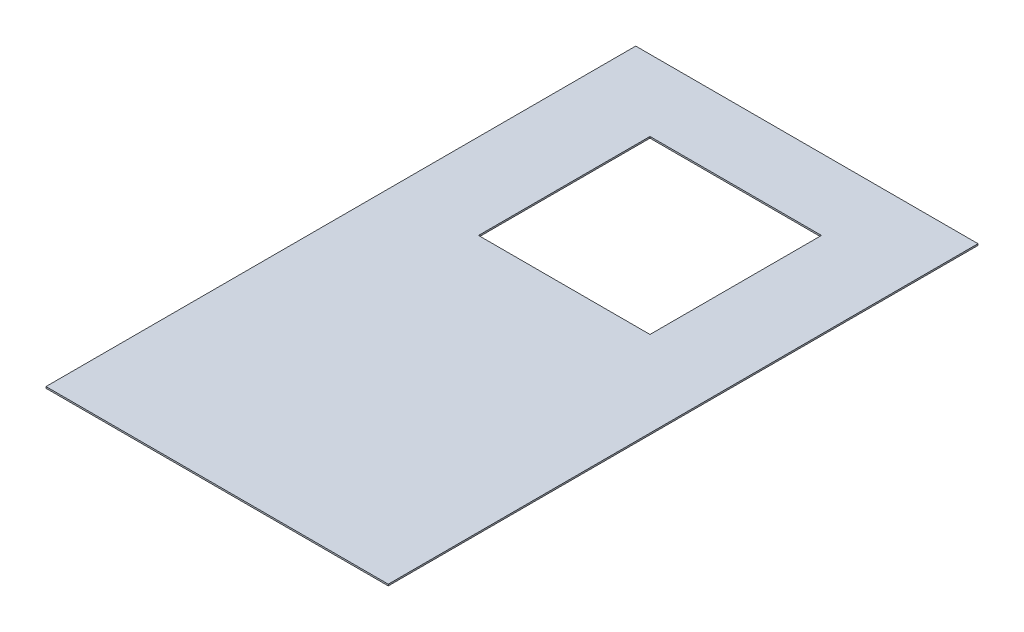
ISO-10303-21;
HEADER;
FILE_DESCRIPTION(('STEP AP214'),'2;1');
FILE_NAME('part.step','',(''),(''),'','','');
FILE_SCHEMA(('AUTOMOTIVE_DESIGN { 1 0 10303 214 1 1 1 1 }'));
ENDSEC;
DATA;
#1=APPLICATION_CONTEXT('core data for automotive mechanical design processes');
#2=APPLICATION_PROTOCOL_DEFINITION('international standard','automotive_design',2000,#1);
#3=PRODUCT_CONTEXT('',#1,'mechanical');
#4=PRODUCT('Part','Part','',(#3));
#5=PRODUCT_RELATED_PRODUCT_CATEGORY('part','',(#4));
#6=PRODUCT_DEFINITION_FORMATION('','',#4);
#7=PRODUCT_DEFINITION_CONTEXT('part definition',#1,'design');
#8=PRODUCT_DEFINITION('design','',#6,#7);
#9=PRODUCT_DEFINITION_SHAPE('','',#8);
#10=(LENGTH_UNIT() NAMED_UNIT(*) SI_UNIT(.MILLI.,.METRE.));
#11=(NAMED_UNIT(*) PLANE_ANGLE_UNIT() SI_UNIT($,.RADIAN.));
#12=(NAMED_UNIT(*) SI_UNIT($,.STERADIAN.) SOLID_ANGLE_UNIT());
#13=UNCERTAINTY_MEASURE_WITH_UNIT(LENGTH_MEASURE(1.E-05),#10,'distance_accuracy_value','');
#14=(GEOMETRIC_REPRESENTATION_CONTEXT(3) GLOBAL_UNCERTAINTY_ASSIGNED_CONTEXT((#13)) GLOBAL_UNIT_ASSIGNED_CONTEXT((#10,
#11,#12)) REPRESENTATION_CONTEXT('',''));
#15=CARTESIAN_POINT('',(0.,0.,0.));
#16=DIRECTION('',(0.,0.,1.));
#17=DIRECTION('',(1.,0.,0.));
#18=AXIS2_PLACEMENT_3D('',#15,#16,#17);
#19=CARTESIAN_POINT('',(609.6,5.55625,1050.29));
#20=DIRECTION('',(-1.,0.,0.));
#21=DIRECTION('',(0.,0.,1.));
#22=AXIS2_PLACEMENT_3D('',#19,#20,#21);
#23=PLANE('',#22);
#24=DIRECTION('',(0.,0.,-1.));
#25=VECTOR('',#24,1.);
#26=CARTESIAN_POINT('',(609.6,0.,1050.29));
#27=LINE('',#26,#25);
#28=CARTESIAN_POINT('',(609.6,0.,1050.29));
#29=VERTEX_POINT('',#28);
#30=CARTESIAN_POINT('',(609.6,0.,-1050.29));
#31=VERTEX_POINT('',#30);
#32=EDGE_CURVE('E135',#29,#31,#27,.T.);
#33=ORIENTED_EDGE('',*,*,#32,.T.);
#34=DIRECTION('',(0.,-1.,0.));
#35=VECTOR('',#34,1.);
#36=CARTESIAN_POINT('',(609.6,5.55625,-1050.29));
#37=LINE('',#36,#35);
#38=CARTESIAN_POINT('',(609.6,5.55625,-1050.29));
#39=VERTEX_POINT('',#38);
#40=EDGE_CURVE('E11',#39,#31,#37,.T.);
#41=ORIENTED_EDGE('',*,*,#40,.F.);
#42=DIRECTION('',(0.,0.,-1.));
#43=VECTOR('',#42,1.);
#44=CARTESIAN_POINT('',(609.6,5.55625,1050.29));
#45=LINE('',#44,#43);
#46=CARTESIAN_POINT('',(609.6,5.55625,1050.29));
#47=VERTEX_POINT('',#46);
#48=EDGE_CURVE('E136',#47,#39,#45,.T.);
#49=ORIENTED_EDGE('',*,*,#48,.F.);
#50=DIRECTION('',(0.,-1.,0.));
#51=VECTOR('',#50,1.);
#52=CARTESIAN_POINT('',(609.6,5.55625,1050.29));
#53=LINE('',#52,#51);
#54=EDGE_CURVE('E146',#47,#29,#53,.T.);
#55=ORIENTED_EDGE('',*,*,#54,.T.);
#56=EDGE_LOOP('',(#33,#41,#49,#55));
#57=FACE_BOUND('',#56,.T.);
#58=ADVANCED_FACE('F37',(#57),#23,.F.);
#59=CARTESIAN_POINT('',(-609.6,5.55625,-1050.29));
#60=DIRECTION('',(0.,0.,1.));
#61=DIRECTION('',(1.,0.,0.));
#62=AXIS2_PLACEMENT_3D('',#59,#60,#61);
#63=PLANE('',#62);
#64=DIRECTION('',(-1.,0.,0.));
#65=VECTOR('',#64,1.);
#66=CARTESIAN_POINT('',(-609.6,0.,-1050.29));
#67=LINE('',#66,#65);
#68=CARTESIAN_POINT('',(-609.6,0.,-1050.29));
#69=VERTEX_POINT('',#68);
#70=EDGE_CURVE('E149',#31,#69,#67,.T.);
#71=ORIENTED_EDGE('',*,*,#70,.T.);
#72=DIRECTION('',(0.,-1.,0.));
#73=VECTOR('',#72,1.);
#74=CARTESIAN_POINT('',(-609.6,5.55625,-1050.29));
#75=LINE('',#74,#73);
#76=CARTESIAN_POINT('',(-609.6,5.55625,-1050.29));
#77=VERTEX_POINT('',#76);
#78=EDGE_CURVE('E44',#77,#69,#75,.T.);
#79=ORIENTED_EDGE('',*,*,#78,.F.);
#80=DIRECTION('',(-1.,0.,0.));
#81=VECTOR('',#80,1.);
#82=CARTESIAN_POINT('',(-609.6,5.55625,-1050.29));
#83=LINE('',#82,#81);
#84=EDGE_CURVE('E139',#39,#77,#83,.T.);
#85=ORIENTED_EDGE('',*,*,#84,.F.);
#86=ORIENTED_EDGE('',*,*,#40,.T.);
#87=EDGE_LOOP('',(#71,#79,#85,#86));
#88=FACE_BOUND('',#87,.T.);
#89=ADVANCED_FACE('F177',(#88),#63,.F.);
#90=CARTESIAN_POINT('',(-609.6,5.55625,1050.29));
#91=DIRECTION('',(1.,0.,0.));
#92=DIRECTION('',(0.,0.,-1.));
#93=AXIS2_PLACEMENT_3D('',#90,#91,#92);
#94=PLANE('',#93);
#95=DIRECTION('',(0.,0.,1.));
#96=VECTOR('',#95,1.);
#97=CARTESIAN_POINT('',(-609.6,0.,1050.29));
#98=LINE('',#97,#96);
#99=CARTESIAN_POINT('',(-609.6,0.,1050.29));
#100=VERTEX_POINT('',#99);
#101=EDGE_CURVE('E151',#69,#100,#98,.T.);
#102=ORIENTED_EDGE('',*,*,#101,.T.);
#103=DIRECTION('',(0.,-1.,0.));
#104=VECTOR('',#103,1.);
#105=CARTESIAN_POINT('',(-609.6,5.55625,1050.29));
#106=LINE('',#105,#104);
#107=CARTESIAN_POINT('',(-609.6,5.55625,1050.29));
#108=VERTEX_POINT('',#107);
#109=EDGE_CURVE('E156',#108,#100,#106,.T.);
#110=ORIENTED_EDGE('',*,*,#109,.F.);
#111=DIRECTION('',(0.,0.,1.));
#112=VECTOR('',#111,1.);
#113=CARTESIAN_POINT('',(-609.6,5.55625,1050.29));
#114=LINE('',#113,#112);
#115=EDGE_CURVE('E142',#77,#108,#114,.T.);
#116=ORIENTED_EDGE('',*,*,#115,.F.);
#117=ORIENTED_EDGE('',*,*,#78,.T.);
#118=EDGE_LOOP('',(#102,#110,#116,#117));
#119=FACE_BOUND('',#118,.T.);
#120=ADVANCED_FACE('F163',(#119),#94,.F.);
#121=CARTESIAN_POINT('',(-609.6,5.55625,1050.29));
#122=DIRECTION('',(0.,0.,-1.));
#123=DIRECTION('',(-1.,0.,0.));
#124=AXIS2_PLACEMENT_3D('',#121,#122,#123);
#125=PLANE('',#124);
#126=DIRECTION('',(1.,0.,0.));
#127=VECTOR('',#126,1.);
#128=CARTESIAN_POINT('',(-609.6,0.,1050.29));
#129=LINE('',#128,#127);
#130=EDGE_CURVE('E140',#100,#29,#129,.T.);
#131=ORIENTED_EDGE('',*,*,#130,.T.);
#132=ORIENTED_EDGE('',*,*,#54,.F.);
#133=DIRECTION('',(1.,0.,0.));
#134=VECTOR('',#133,1.);
#135=CARTESIAN_POINT('',(-609.6,5.55625,1050.29));
#136=LINE('',#135,#134);
#137=EDGE_CURVE('E144',#108,#47,#136,.T.);
#138=ORIENTED_EDGE('',*,*,#137,.F.);
#139=ORIENTED_EDGE('',*,*,#109,.T.);
#140=EDGE_LOOP('',(#131,#132,#138,#139));
#141=FACE_BOUND('',#140,.T.);
#142=ADVANCED_FACE('F170',(#141),#125,.F.);
#143=CARTESIAN_POINT('',(0.,5.55625,0.));
#144=DIRECTION('',(0.,-1.,0.));
#145=DIRECTION('',(0.,0.,-1.));
#146=AXIS2_PLACEMENT_3D('',#143,#144,#145);
#147=PLANE('',#146);
#148=DIRECTION('',(-1.,0.,0.));
#149=VECTOR('',#148,1.);
#150=CARTESIAN_POINT('',(0.,5.55625,-186.054999999638));
#151=LINE('',#150,#149);
#152=CARTESIAN_POINT('',(305.43500000015,5.55625,-186.054999999638));
#153=VERTEX_POINT('',#152);
#154=CARTESIAN_POINT('',(-305.43499999985,5.55625,-186.054999999638));
#155=VERTEX_POINT('',#154);
#156=EDGE_CURVE('E124',#153,#155,#151,.T.);
#157=ORIENTED_EDGE('',*,*,#156,.T.);
#158=DIRECTION('',(0.,0.,-1.));
#159=VECTOR('',#158,1.);
#160=CARTESIAN_POINT('',(-305.43499999985,5.55625,0.));
#161=LINE('',#160,#159);
#162=CARTESIAN_POINT('',(-305.43499999985,5.55625,-796.924999999638));
#163=VERTEX_POINT('',#162);
#164=EDGE_CURVE('E105',#155,#163,#161,.T.);
#165=ORIENTED_EDGE('',*,*,#164,.T.);
#166=DIRECTION('',(-1.,0.,0.));
#167=VECTOR('',#166,1.);
#168=CARTESIAN_POINT('',(0.,5.55625,-796.924999999638));
#169=LINE('',#168,#167);
#170=CARTESIAN_POINT('',(305.43500000015,5.55625,-796.924999999638));
#171=VERTEX_POINT('',#170);
#172=EDGE_CURVE('E132',#171,#163,#169,.T.);
#173=ORIENTED_EDGE('',*,*,#172,.F.);
#174=DIRECTION('',(0.,0.,-1.));
#175=VECTOR('',#174,1.);
#176=CARTESIAN_POINT('',(305.43500000015,5.55625,0.));
#177=LINE('',#176,#175);
#178=EDGE_CURVE('E130',#153,#171,#177,.T.);
#179=ORIENTED_EDGE('',*,*,#178,.F.);
#180=EDGE_LOOP('',(#157,#165,#173,#179));
#181=FACE_BOUND('',#180,.T.);
#182=ORIENTED_EDGE('',*,*,#48,.T.);
#183=ORIENTED_EDGE('',*,*,#84,.T.);
#184=ORIENTED_EDGE('',*,*,#115,.T.);
#185=ORIENTED_EDGE('',*,*,#137,.T.);
#186=EDGE_LOOP('',(#182,#183,#184,#185));
#187=FACE_BOUND('',#186,.T.);
#188=ADVANCED_FACE('F176',(#181,#187),#147,.F.);
#189=CARTESIAN_POINT('',(0.,0.,0.));
#190=DIRECTION('',(0.,-1.,0.));
#191=DIRECTION('',(0.,0.,-1.));
#192=AXIS2_PLACEMENT_3D('',#189,#190,#191);
#193=PLANE('',#192);
#194=DIRECTION('',(0.,0.,1.));
#195=VECTOR('',#194,1.);
#196=CARTESIAN_POINT('',(-305.43499999985,0.,-796.924999999638));
#197=LINE('',#196,#195);
#198=CARTESIAN_POINT('',(-305.43499999985,0.,-796.924999999638));
#199=VERTEX_POINT('',#198);
#200=CARTESIAN_POINT('',(-305.43499999985,0.,-186.054999999638));
#201=VERTEX_POINT('',#200);
#202=EDGE_CURVE('E102',#199,#201,#197,.T.);
#203=ORIENTED_EDGE('',*,*,#202,.T.);
#204=DIRECTION('',(1.,0.,0.));
#205=VECTOR('',#204,1.);
#206=CARTESIAN_POINT('',(-305.43499999985,0.,-186.054999999638));
#207=LINE('',#206,#205);
#208=CARTESIAN_POINT('',(305.43500000015,0.,-186.054999999638));
#209=VERTEX_POINT('',#208);
#210=EDGE_CURVE('E110',#201,#209,#207,.T.);
#211=ORIENTED_EDGE('',*,*,#210,.T.);
#212=DIRECTION('',(0.,0.,1.));
#213=VECTOR('',#212,1.);
#214=CARTESIAN_POINT('',(305.43500000015,0.,-796.924999999638));
#215=LINE('',#214,#213);
#216=CARTESIAN_POINT('',(305.43500000015,0.,-796.924999999638));
#217=VERTEX_POINT('',#216);
#218=EDGE_CURVE('E114',#217,#209,#215,.T.);
#219=ORIENTED_EDGE('',*,*,#218,.F.);
#220=DIRECTION('',(1.,0.,0.));
#221=VECTOR('',#220,1.);
#222=CARTESIAN_POINT('',(-305.43499999985,0.,-796.924999999638));
#223=LINE('',#222,#221);
#224=EDGE_CURVE('E107',#199,#217,#223,.T.);
#225=ORIENTED_EDGE('',*,*,#224,.F.);
#226=EDGE_LOOP('',(#203,#211,#219,#225));
#227=FACE_BOUND('',#226,.T.);
#228=ORIENTED_EDGE('',*,*,#32,.F.);
#229=ORIENTED_EDGE('',*,*,#130,.F.);
#230=ORIENTED_EDGE('',*,*,#101,.F.);
#231=ORIENTED_EDGE('',*,*,#70,.F.);
#232=EDGE_LOOP('',(#228,#229,#230,#231));
#233=FACE_BOUND('',#232,.T.);
#234=ADVANCED_FACE('F116',(#227,#233),#193,.T.);
#235=CARTESIAN_POINT('',(-305.43499999985,0.,-796.924999999638));
#236=DIRECTION('',(-1.,0.,0.));
#237=DIRECTION('',(0.,0.,1.));
#238=AXIS2_PLACEMENT_3D('',#235,#236,#237);
#239=PLANE('',#238);
#240=DIRECTION('',(0.,1.,0.));
#241=VECTOR('',#240,1.);
#242=CARTESIAN_POINT('',(-305.43499999985,0.,-186.054999999638));
#243=LINE('',#242,#241);
#244=EDGE_CURVE('E51',#201,#155,#243,.T.);
#245=ORIENTED_EDGE('',*,*,#244,.F.);
#246=ORIENTED_EDGE('',*,*,#202,.F.);
#247=DIRECTION('',(0.,1.,0.));
#248=VECTOR('',#247,1.);
#249=CARTESIAN_POINT('',(-305.43499999985,0.,-796.924999999638));
#250=LINE('',#249,#248);
#251=EDGE_CURVE('E122',#199,#163,#250,.T.);
#252=ORIENTED_EDGE('',*,*,#251,.T.);
#253=ORIENTED_EDGE('',*,*,#164,.F.);
#254=EDGE_LOOP('',(#245,#246,#252,#253));
#255=FACE_BOUND('',#254,.T.);
#256=ADVANCED_FACE('F99',(#255),#239,.F.);
#257=CARTESIAN_POINT('',(-305.43499999985,0.,-796.924999999638));
#258=DIRECTION('',(0.,0.,1.));
#259=DIRECTION('',(1.,0.,0.));
#260=AXIS2_PLACEMENT_3D('',#257,#258,#259);
#261=PLANE('',#260);
#262=ORIENTED_EDGE('',*,*,#172,.T.);
#263=ORIENTED_EDGE('',*,*,#251,.F.);
#264=ORIENTED_EDGE('',*,*,#224,.T.);
#265=DIRECTION('',(0.,1.,0.));
#266=VECTOR('',#265,1.);
#267=CARTESIAN_POINT('',(305.43500000015,0.,-796.924999999638));
#268=LINE('',#267,#266);
#269=EDGE_CURVE('E125',#217,#171,#268,.T.);
#270=ORIENTED_EDGE('',*,*,#269,.T.);
#271=EDGE_LOOP('',(#262,#263,#264,#270));
#272=FACE_BOUND('',#271,.T.);
#273=ADVANCED_FACE('F194',(#272),#261,.T.);
#274=CARTESIAN_POINT('',(305.43500000015,0.,-796.924999999638));
#275=DIRECTION('',(-1.,0.,0.));
#276=DIRECTION('',(0.,0.,1.));
#277=AXIS2_PLACEMENT_3D('',#274,#275,#276);
#278=PLANE('',#277);
#279=ORIENTED_EDGE('',*,*,#178,.T.);
#280=ORIENTED_EDGE('',*,*,#269,.F.);
#281=ORIENTED_EDGE('',*,*,#218,.T.);
#282=DIRECTION('',(0.,1.,0.));
#283=VECTOR('',#282,1.);
#284=CARTESIAN_POINT('',(305.43500000015,0.,-186.054999999638));
#285=LINE('',#284,#283);
#286=EDGE_CURVE('E56',#209,#153,#285,.T.);
#287=ORIENTED_EDGE('',*,*,#286,.T.);
#288=EDGE_LOOP('',(#279,#280,#281,#287));
#289=FACE_BOUND('',#288,.T.);
#290=ADVANCED_FACE('F197',(#289),#278,.T.);
#291=CARTESIAN_POINT('',(-305.43499999985,0.,-186.054999999638));
#292=DIRECTION('',(0.,0.,1.));
#293=DIRECTION('',(1.,0.,0.));
#294=AXIS2_PLACEMENT_3D('',#291,#292,#293);
#295=PLANE('',#294);
#296=ORIENTED_EDGE('',*,*,#286,.F.);
#297=ORIENTED_EDGE('',*,*,#210,.F.);
#298=ORIENTED_EDGE('',*,*,#244,.T.);
#299=ORIENTED_EDGE('',*,*,#156,.F.);
#300=EDGE_LOOP('',(#296,#297,#298,#299));
#301=FACE_BOUND('',#300,.T.);
#302=ADVANCED_FACE('F111',(#301),#295,.F.);
#303=CLOSED_SHELL('',(#58,#89,#120,#142,#188,#234,#256,#273,#290,#302));
#304=MANIFOLD_SOLID_BREP('B2',#303);
#305=ADVANCED_BREP_SHAPE_REPRESENTATION('',(#18,#304),#14);
#306=SHAPE_DEFINITION_REPRESENTATION(#9,#305);
ENDSEC;
END-ISO-10303-21;
